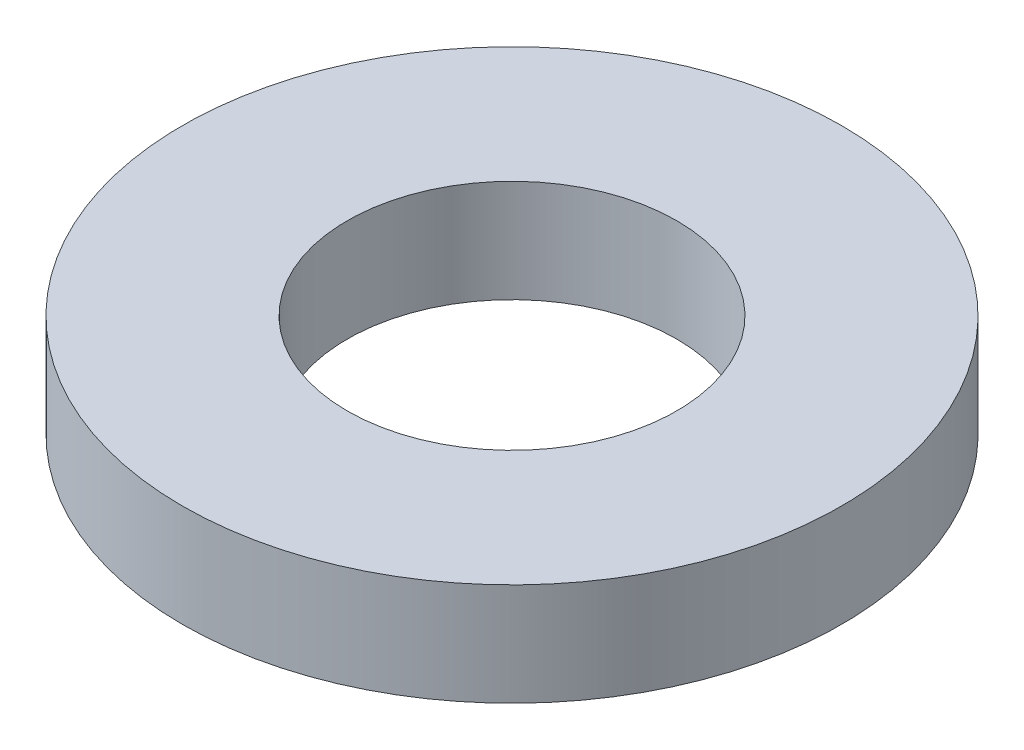
ISO-10303-21;
HEADER;
FILE_DESCRIPTION(('STEP AP214'),'2;1');
FILE_NAME('part.step','',(''),(''),'','','');
FILE_SCHEMA(('AUTOMOTIVE_DESIGN { 1 0 10303 214 1 1 1 1 }'));
ENDSEC;
DATA;
#1=APPLICATION_CONTEXT('core data for automotive mechanical design processes');
#2=APPLICATION_PROTOCOL_DEFINITION('international standard','automotive_design',2000,#1);
#3=PRODUCT_CONTEXT('',#1,'mechanical');
#4=PRODUCT('Part','Part','',(#3));
#5=PRODUCT_RELATED_PRODUCT_CATEGORY('part','',(#4));
#6=PRODUCT_DEFINITION_FORMATION('','',#4);
#7=PRODUCT_DEFINITION_CONTEXT('part definition',#1,'design');
#8=PRODUCT_DEFINITION('design','',#6,#7);
#9=PRODUCT_DEFINITION_SHAPE('','',#8);
#10=(LENGTH_UNIT() NAMED_UNIT(*) SI_UNIT(.MILLI.,.METRE.));
#11=(NAMED_UNIT(*) PLANE_ANGLE_UNIT() SI_UNIT($,.RADIAN.));
#12=(NAMED_UNIT(*) SI_UNIT($,.STERADIAN.) SOLID_ANGLE_UNIT());
#13=UNCERTAINTY_MEASURE_WITH_UNIT(LENGTH_MEASURE(1.E-05),#10,'distance_accuracy_value','');
#14=(GEOMETRIC_REPRESENTATION_CONTEXT(3) GLOBAL_UNCERTAINTY_ASSIGNED_CONTEXT((#13)) GLOBAL_UNIT_ASSIGNED_CONTEXT((#10,
#11,#12)) REPRESENTATION_CONTEXT('',''));
#15=CARTESIAN_POINT('',(0.,0.,0.));
#16=DIRECTION('',(0.,0.,1.));
#17=DIRECTION('',(1.,0.,0.));
#18=AXIS2_PLACEMENT_3D('',#15,#16,#17);
#19=CARTESIAN_POINT('',(0.,14.,0.));
#20=DIRECTION('',(0.,-1.,0.));
#21=DIRECTION('',(0.,0.,-1.));
#22=AXIS2_PLACEMENT_3D('',#19,#20,#21);
#23=CYLINDRICAL_SURFACE('',#22,45.);
#24=CARTESIAN_POINT('',(0.,14.,0.));
#25=DIRECTION('',(0.,1.,0.));
#26=DIRECTION('',(0.,0.,1.));
#27=AXIS2_PLACEMENT_3D('',#24,#25,#26);
#28=CIRCLE('',#27,45.);
#29=CARTESIAN_POINT('',(0.,14.,45.));
#30=VERTEX_POINT('',#29);
#31=EDGE_CURVE('E10',#30,#30,#28,.T.);
#32=ORIENTED_EDGE('',*,*,#31,.F.);
#33=EDGE_LOOP('',(#32));
#34=FACE_BOUND('',#33,.T.);
#35=CARTESIAN_POINT('',(0.,0.,0.));
#36=DIRECTION('',(0.,1.,0.));
#37=DIRECTION('',(0.,0.,1.));
#38=AXIS2_PLACEMENT_3D('',#35,#36,#37);
#39=CIRCLE('',#38,45.);
#40=CARTESIAN_POINT('',(0.,0.,45.));
#41=VERTEX_POINT('',#40);
#42=EDGE_CURVE('E37',#41,#41,#39,.T.);
#43=ORIENTED_EDGE('',*,*,#42,.T.);
#44=EDGE_LOOP('',(#43));
#45=FACE_BOUND('',#44,.T.);
#46=ADVANCED_FACE('F40',(#34,#45),#23,.T.);
#47=CARTESIAN_POINT('',(0.,14.,0.));
#48=DIRECTION('',(0.,1.,0.));
#49=DIRECTION('',(0.,0.,1.));
#50=AXIS2_PLACEMENT_3D('',#47,#48,#49);
#51=PLANE('',#50);
#52=CARTESIAN_POINT('',(0.,14.,0.));
#53=DIRECTION('',(0.,1.,0.));
#54=DIRECTION('',(0.,0.,1.));
#55=AXIS2_PLACEMENT_3D('',#52,#53,#54);
#56=CIRCLE('',#55,22.5);
#57=CARTESIAN_POINT('',(0.,14.,22.5));
#58=VERTEX_POINT('',#57);
#59=EDGE_CURVE('E50',#58,#58,#56,.T.);
#60=ORIENTED_EDGE('',*,*,#59,.F.);
#61=EDGE_LOOP('',(#60));
#62=FACE_BOUND('',#61,.T.);
#63=ORIENTED_EDGE('',*,*,#31,.T.);
#64=EDGE_LOOP('',(#63));
#65=FACE_BOUND('',#64,.T.);
#66=ADVANCED_FACE('F59',(#62,#65),#51,.T.);
#67=CARTESIAN_POINT('',(0.,0.,0.));
#68=DIRECTION('',(0.,1.,0.));
#69=DIRECTION('',(0.,0.,1.));
#70=AXIS2_PLACEMENT_3D('',#67,#68,#69);
#71=PLANE('',#70);
#72=CARTESIAN_POINT('',(0.,0.,0.));
#73=DIRECTION('',(0.,1.,0.));
#74=DIRECTION('',(0.,0.,1.));
#75=AXIS2_PLACEMENT_3D('',#72,#73,#74);
#76=CIRCLE('',#75,22.5);
#77=CARTESIAN_POINT('',(0.,0.,22.5));
#78=VERTEX_POINT('',#77);
#79=EDGE_CURVE('E47',#78,#78,#76,.T.);
#80=ORIENTED_EDGE('',*,*,#79,.T.);
#81=EDGE_LOOP('',(#80));
#82=FACE_BOUND('',#81,.T.);
#83=ORIENTED_EDGE('',*,*,#42,.F.);
#84=EDGE_LOOP('',(#83));
#85=FACE_BOUND('',#84,.T.);
#86=ADVANCED_FACE('F58',(#82,#85),#71,.F.);
#87=CARTESIAN_POINT('',(0.,14.,0.));
#88=DIRECTION('',(0.,-1.,0.));
#89=DIRECTION('',(0.,0.,-1.));
#90=AXIS2_PLACEMENT_3D('',#87,#88,#89);
#91=CYLINDRICAL_SURFACE('',#90,22.5);
#92=ORIENTED_EDGE('',*,*,#59,.T.);
#93=EDGE_LOOP('',(#92));
#94=FACE_BOUND('',#93,.T.);
#95=ORIENTED_EDGE('',*,*,#79,.F.);
#96=EDGE_LOOP('',(#95));
#97=FACE_BOUND('',#96,.T.);
#98=ADVANCED_FACE('F54',(#94,#97),#91,.F.);
#99=CLOSED_SHELL('',(#46,#66,#86,#98));
#100=MANIFOLD_SOLID_BREP('B2',#99);
#101=ADVANCED_BREP_SHAPE_REPRESENTATION('',(#18,#100),#14);
#102=SHAPE_DEFINITION_REPRESENTATION(#9,#101);
ENDSEC;
END-ISO-10303-21;
